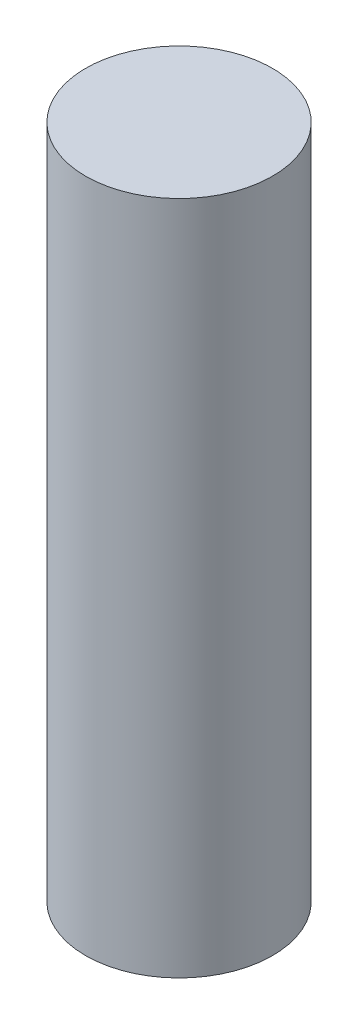
ISO-10303-21;
HEADER;
FILE_DESCRIPTION(('STEP AP214'),'2;1');
FILE_NAME('part.step','',(''),(''),'','','');
FILE_SCHEMA(('AUTOMOTIVE_DESIGN { 1 0 10303 214 1 1 1 1 }'));
ENDSEC;
DATA;
#1=APPLICATION_CONTEXT('core data for automotive mechanical design processes');
#2=APPLICATION_PROTOCOL_DEFINITION('international standard','automotive_design',2000,#1);
#3=PRODUCT_CONTEXT('',#1,'mechanical');
#4=PRODUCT('Part','Part','',(#3));
#5=PRODUCT_RELATED_PRODUCT_CATEGORY('part','',(#4));
#6=PRODUCT_DEFINITION_FORMATION('','',#4);
#7=PRODUCT_DEFINITION_CONTEXT('part definition',#1,'design');
#8=PRODUCT_DEFINITION('design','',#6,#7);
#9=PRODUCT_DEFINITION_SHAPE('','',#8);
#10=(LENGTH_UNIT() NAMED_UNIT(*) SI_UNIT(.MILLI.,.METRE.));
#11=(NAMED_UNIT(*) PLANE_ANGLE_UNIT() SI_UNIT($,.RADIAN.));
#12=(NAMED_UNIT(*) SI_UNIT($,.STERADIAN.) SOLID_ANGLE_UNIT());
#13=UNCERTAINTY_MEASURE_WITH_UNIT(LENGTH_MEASURE(1.E-05),#10,'distance_accuracy_value','');
#14=(GEOMETRIC_REPRESENTATION_CONTEXT(3) GLOBAL_UNCERTAINTY_ASSIGNED_CONTEXT((#13)) GLOBAL_UNIT_ASSIGNED_CONTEXT((#10,
#11,#12)) REPRESENTATION_CONTEXT('',''));
#15=CARTESIAN_POINT('',(0.,0.,0.));
#16=DIRECTION('',(0.,0.,1.));
#17=DIRECTION('',(1.,0.,0.));
#18=AXIS2_PLACEMENT_3D('',#15,#16,#17);
#19=CARTESIAN_POINT('',(0.,65.,0.));
#20=DIRECTION('',(0.,-1.,0.));
#21=DIRECTION('',(0.,0.,-1.));
#22=AXIS2_PLACEMENT_3D('',#19,#20,#21);
#23=CYLINDRICAL_SURFACE('',#22,9.);
#24=CARTESIAN_POINT('',(0.,65.,0.));
#25=DIRECTION('',(0.,1.,0.));
#26=DIRECTION('',(0.,0.,1.));
#27=AXIS2_PLACEMENT_3D('',#24,#25,#26);
#28=CIRCLE('',#27,9.);
#29=CARTESIAN_POINT('',(0.,65.,9.));
#30=VERTEX_POINT('',#29);
#31=EDGE_CURVE('E10',#30,#30,#28,.T.);
#32=ORIENTED_EDGE('',*,*,#31,.F.);
#33=EDGE_LOOP('',(#32));
#34=FACE_BOUND('',#33,.T.);
#35=CARTESIAN_POINT('',(0.,0.,0.));
#36=DIRECTION('',(0.,1.,0.));
#37=DIRECTION('',(0.,0.,1.));
#38=AXIS2_PLACEMENT_3D('',#35,#36,#37);
#39=CIRCLE('',#38,9.);
#40=CARTESIAN_POINT('',(0.,0.,9.));
#41=VERTEX_POINT('',#40);
#42=EDGE_CURVE('E33',#41,#41,#39,.T.);
#43=ORIENTED_EDGE('',*,*,#42,.T.);
#44=EDGE_LOOP('',(#43));
#45=FACE_BOUND('',#44,.T.);
#46=ADVANCED_FACE('F30',(#34,#45),#23,.T.);
#47=CARTESIAN_POINT('',(0.,65.,0.));
#48=DIRECTION('',(0.,1.,0.));
#49=DIRECTION('',(0.,0.,1.));
#50=AXIS2_PLACEMENT_3D('',#47,#48,#49);
#51=PLANE('',#50);
#52=ORIENTED_EDGE('',*,*,#31,.T.);
#53=EDGE_LOOP('',(#52));
#54=FACE_BOUND('',#53,.T.);
#55=ADVANCED_FACE('F45',(#54),#51,.T.);
#56=CARTESIAN_POINT('',(0.,0.,0.));
#57=DIRECTION('',(0.,1.,0.));
#58=DIRECTION('',(0.,0.,1.));
#59=AXIS2_PLACEMENT_3D('',#56,#57,#58);
#60=PLANE('',#59);
#61=ORIENTED_EDGE('',*,*,#42,.F.);
#62=EDGE_LOOP('',(#61));
#63=FACE_BOUND('',#62,.T.);
#64=ADVANCED_FACE('F43',(#63),#60,.F.);
#65=CLOSED_SHELL('',(#46,#55,#64));
#66=MANIFOLD_SOLID_BREP('B2',#65);
#67=ADVANCED_BREP_SHAPE_REPRESENTATION('',(#18,#66),#14);
#68=SHAPE_DEFINITION_REPRESENTATION(#9,#67);
ENDSEC;
END-ISO-10303-21;
